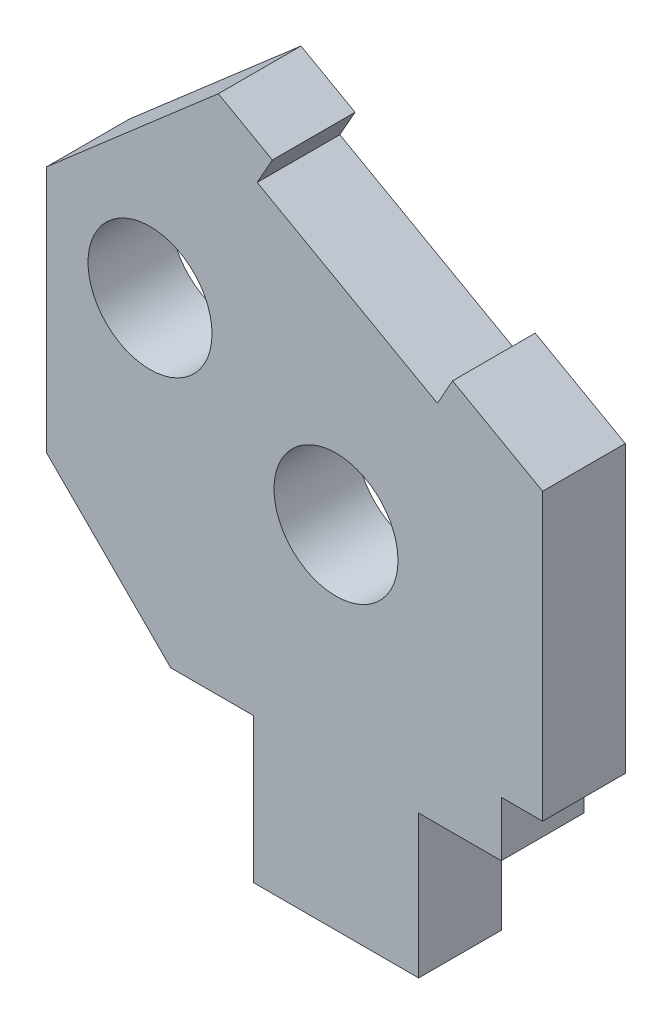
ISO-10303-21;
HEADER;
FILE_DESCRIPTION(('STEP AP214'),'2;1');
FILE_NAME('part.step','',(''),(''),'','','');
FILE_SCHEMA(('AUTOMOTIVE_DESIGN { 1 0 10303 214 1 1 1 1 }'));
ENDSEC;
DATA;
#1=APPLICATION_CONTEXT('core data for automotive mechanical design processes');
#2=APPLICATION_PROTOCOL_DEFINITION('international standard','automotive_design',2000,#1);
#3=PRODUCT_CONTEXT('',#1,'mechanical');
#4=PRODUCT('Part','Part','',(#3));
#5=PRODUCT_RELATED_PRODUCT_CATEGORY('part','',(#4));
#6=PRODUCT_DEFINITION_FORMATION('','',#4);
#7=PRODUCT_DEFINITION_CONTEXT('part definition',#1,'design');
#8=PRODUCT_DEFINITION('design','',#6,#7);
#9=PRODUCT_DEFINITION_SHAPE('','',#8);
#10=(LENGTH_UNIT() NAMED_UNIT(*) SI_UNIT(.MILLI.,.METRE.));
#11=(NAMED_UNIT(*) PLANE_ANGLE_UNIT() SI_UNIT($,.RADIAN.));
#12=(NAMED_UNIT(*) SI_UNIT($,.STERADIAN.) SOLID_ANGLE_UNIT());
#13=UNCERTAINTY_MEASURE_WITH_UNIT(LENGTH_MEASURE(1.E-05),#10,'distance_accuracy_value','');
#14=(GEOMETRIC_REPRESENTATION_CONTEXT(3) GLOBAL_UNCERTAINTY_ASSIGNED_CONTEXT((#13)) GLOBAL_UNIT_ASSIGNED_CONTEXT((#10,
#11,#12)) REPRESENTATION_CONTEXT('',''));
#15=CARTESIAN_POINT('',(0.,0.,0.));
#16=DIRECTION('',(0.,0.,1.));
#17=DIRECTION('',(1.,0.,0.));
#18=AXIS2_PLACEMENT_3D('',#15,#16,#17);
#19=CARTESIAN_POINT('',(0.,0.,4.));
#20=DIRECTION('',(0.,0.,1.));
#21=DIRECTION('',(1.,0.,0.));
#22=AXIS2_PLACEMENT_3D('',#19,#20,#21);
#23=PLANE('',#22);
#24=CARTESIAN_POINT('',(-5.00000000000018,22.,4.));
#25=DIRECTION('',(0.,0.,1.));
#26=DIRECTION('',(1.,0.,0.));
#27=AXIS2_PLACEMENT_3D('',#24,#25,#26);
#28=CIRCLE('',#27,3.);
#29=CARTESIAN_POINT('',(-2.00000000000018,22.,4.));
#30=VERTEX_POINT('',#29);
#31=EDGE_CURVE('E184',#30,#30,#28,.T.);
#32=ORIENTED_EDGE('',*,*,#31,.F.);
#33=EDGE_LOOP('',(#32));
#34=FACE_BOUND('',#33,.T.);
#35=DIRECTION('',(1.,0.,0.));
#36=VECTOR('',#35,1.);
#37=CARTESIAN_POINT('',(14.0000000000007,9.57269183261323,4.));
#38=LINE('',#37,#36);
#39=CARTESIAN_POINT('',(12.0000000000007,9.57269183261323,4.));
#40=VERTEX_POINT('',#39);
#41=CARTESIAN_POINT('',(14.0000000000007,9.57269183261323,4.));
#42=VERTEX_POINT('',#41);
#43=EDGE_CURVE('E210',#40,#42,#38,.T.);
#44=ORIENTED_EDGE('',*,*,#43,.T.);
#45=DIRECTION('',(0.,1.,0.));
#46=VECTOR('',#45,1.);
#47=CARTESIAN_POINT('',(14.0000000000006,23.3993728390653,4.));
#48=LINE('',#47,#46);
#49=CARTESIAN_POINT('',(14.0000000000006,23.3993728390653,4.));
#50=VERTEX_POINT('',#49);
#51=EDGE_CURVE('E120',#42,#50,#48,.T.);
#52=ORIENTED_EDGE('',*,*,#51,.T.);
#53=DIRECTION('',(-0.871930936284606,0.489628882266816,0.));
#54=VECTOR('',#53,1.);
#55=CARTESIAN_POINT('',(9.64034531857762,25.8475172503994,4.));
#56=LINE('',#55,#54);
#57=CARTESIAN_POINT('',(9.64034531857762,25.8475172503994,4.));
#58=VERTEX_POINT('',#57);
#59=EDGE_CURVE('E286',#50,#58,#56,.T.);
#60=ORIENTED_EDGE('',*,*,#59,.T.);
#61=DIRECTION('',(-0.489628882266828,-0.871930936284599,0.));
#62=VECTOR('',#61,1.);
#63=CARTESIAN_POINT('',(8.90590199517738,24.5396208459725,4.));
#64=LINE('',#63,#62);
#65=CARTESIAN_POINT('',(8.90590199517738,24.5396208459725,4.));
#66=VERTEX_POINT('',#65);
#67=EDGE_CURVE('E284',#58,#66,#64,.T.);
#68=ORIENTED_EDGE('',*,*,#67,.T.);
#69=DIRECTION('',(-0.871930936284605,0.489628882266816,0.));
#70=VECTOR('',#69,1.);
#71=CARTESIAN_POINT('',(0.186592632331326,29.4359096686407,4.));
#72=LINE('',#71,#70);
#73=CARTESIAN_POINT('',(0.186592632331326,29.4359096686407,4.));
#74=VERTEX_POINT('',#73);
#75=EDGE_CURVE('E282',#66,#74,#72,.T.);
#76=ORIENTED_EDGE('',*,*,#75,.T.);
#77=DIRECTION('',(0.489628882266816,0.871930936284605,0.));
#78=VECTOR('',#77,1.);
#79=CARTESIAN_POINT('',(0.921035955731546,30.7438060730676,4.));
#80=LINE('',#79,#78);
#81=CARTESIAN_POINT('',(0.921035955731546,30.7438060730676,4.));
#82=VERTEX_POINT('',#81);
#83=EDGE_CURVE('E280',#74,#82,#80,.T.);
#84=ORIENTED_EDGE('',*,*,#83,.T.);
#85=DIRECTION('',(-0.871930936284605,0.489628882266816,0.));
#86=VECTOR('',#85,1.);
#87=CARTESIAN_POINT('',(-1.69475685312225,32.212692719868,4.));
#88=LINE('',#87,#86);
#89=CARTESIAN_POINT('',(-1.69475685312225,32.212692719868,4.));
#90=VERTEX_POINT('',#89);
#91=EDGE_CURVE('E278',#82,#90,#88,.T.);
#92=ORIENTED_EDGE('',*,*,#91,.T.);
#93=DIRECTION('',(-0.75502210426163,-0.65569933816982,0.));
#94=VECTOR('',#93,1.);
#95=CARTESIAN_POINT('',(-10.0000000000002,25.,4.));
#96=LINE('',#95,#94);
#97=CARTESIAN_POINT('',(-10.0000000000002,25.,4.));
#98=VERTEX_POINT('',#97);
#99=EDGE_CURVE('E274',#90,#98,#96,.T.);
#100=ORIENTED_EDGE('',*,*,#99,.T.);
#101=DIRECTION('',(0.,-1.,0.));
#102=VECTOR('',#101,1.);
#103=CARTESIAN_POINT('',(-10.0000000000002,25.,4.));
#104=LINE('',#103,#102);
#105=CARTESIAN_POINT('',(-10.0000000000002,13.,4.));
#106=VERTEX_POINT('',#105);
#107=EDGE_CURVE('E267',#98,#106,#104,.T.);
#108=ORIENTED_EDGE('',*,*,#107,.T.);
#109=DIRECTION('',(-0.707106781186543,0.707106781186552,0.));
#110=VECTOR('',#109,1.);
#111=CARTESIAN_POINT('',(-3.99999999999998,6.99999999999995,4.));
#112=LINE('',#111,#110);
#113=CARTESIAN_POINT('',(-3.99999999999998,7.,4.));
#114=VERTEX_POINT('',#113);
#115=EDGE_CURVE('E11',#106,#114,#112,.F.);
#116=ORIENTED_EDGE('',*,*,#115,.T.);
#117=DIRECTION('',(1.,0.,0.));
#118=VECTOR('',#117,1.);
#119=CARTESIAN_POINT('',(-3.99999999999998,7.,4.));
#120=LINE('',#119,#118);
#121=CARTESIAN_POINT('',(0.,7.,4.));
#122=VERTEX_POINT('',#121);
#123=EDGE_CURVE('E265',#114,#122,#120,.T.);
#124=ORIENTED_EDGE('',*,*,#123,.T.);
#125=DIRECTION('',(0.,-1.,0.));
#126=VECTOR('',#125,1.);
#127=CARTESIAN_POINT('',(0.,7.,4.));
#128=LINE('',#127,#126);
#129=CARTESIAN_POINT('',(0.,0.,4.));
#130=VERTEX_POINT('',#129);
#131=EDGE_CURVE('E271',#122,#130,#128,.T.);
#132=ORIENTED_EDGE('',*,*,#131,.T.);
#133=DIRECTION('',(1.,0.,0.));
#134=VECTOR('',#133,1.);
#135=CARTESIAN_POINT('',(0.,0.,4.));
#136=LINE('',#135,#134);
#137=CARTESIAN_POINT('',(8.00000000000002,0.,4.));
#138=VERTEX_POINT('',#137);
#139=EDGE_CURVE('E162',#130,#138,#136,.T.);
#140=ORIENTED_EDGE('',*,*,#139,.T.);
#141=DIRECTION('',(0.,1.,0.));
#142=VECTOR('',#141,1.);
#143=CARTESIAN_POINT('',(8.00000000000002,0.,4.));
#144=LINE('',#143,#142);
#145=CARTESIAN_POINT('',(8.,6.91505180853556,4.));
#146=VERTEX_POINT('',#145);
#147=EDGE_CURVE('E156',#138,#146,#144,.T.);
#148=ORIENTED_EDGE('',*,*,#147,.T.);
#149=DIRECTION('',(1.,0.,0.));
#150=VECTOR('',#149,1.);
#151=CARTESIAN_POINT('',(8.,6.91505180853556,4.));
#152=LINE('',#151,#150);
#153=CARTESIAN_POINT('',(12.0000000000006,6.91505180853556,4.));
#154=VERTEX_POINT('',#153);
#155=EDGE_CURVE('E160',#146,#154,#152,.T.);
#156=ORIENTED_EDGE('',*,*,#155,.T.);
#157=DIRECTION('',(0.,1.,0.));
#158=VECTOR('',#157,1.);
#159=CARTESIAN_POINT('',(12.0000000000007,9.57269183261323,4.));
#160=LINE('',#159,#158);
#161=EDGE_CURVE('E52',#154,#40,#160,.T.);
#162=ORIENTED_EDGE('',*,*,#161,.T.);
#163=EDGE_LOOP('',(#44,#52,#60,#68,#76,#84,#92,#100,#108,#116,#124,#132,#140,#148,#156,#162));
#164=FACE_BOUND('',#163,.T.);
#165=CARTESIAN_POINT('',(3.99999999999982,17.,4.));
#166=DIRECTION('',(0.,0.,1.));
#167=DIRECTION('',(1.,0.,0.));
#168=AXIS2_PLACEMENT_3D('',#165,#166,#167);
#169=CIRCLE('',#168,3.);
#170=CARTESIAN_POINT('',(6.99999999999982,17.,4.));
#171=VERTEX_POINT('',#170);
#172=EDGE_CURVE('E293',#171,#171,#169,.T.);
#173=ORIENTED_EDGE('',*,*,#172,.F.);
#174=EDGE_LOOP('',(#173));
#175=FACE_BOUND('',#174,.T.);
#176=ADVANCED_FACE('F35',(#34,#164,#175),#23,.T.);
#177=CARTESIAN_POINT('',(0.,0.,0.));
#178=DIRECTION('',(0.,0.,1.));
#179=DIRECTION('',(1.,0.,0.));
#180=AXIS2_PLACEMENT_3D('',#177,#178,#179);
#181=PLANE('',#180);
#182=CARTESIAN_POINT('',(-5.00000000000018,22.,0.));
#183=DIRECTION('',(0.,0.,1.));
#184=DIRECTION('',(1.,0.,0.));
#185=AXIS2_PLACEMENT_3D('',#182,#183,#184);
#186=CIRCLE('',#185,3.);
#187=CARTESIAN_POINT('',(-2.00000000000018,22.,0.));
#188=VERTEX_POINT('',#187);
#189=EDGE_CURVE('E290',#188,#188,#186,.T.);
#190=ORIENTED_EDGE('',*,*,#189,.T.);
#191=EDGE_LOOP('',(#190));
#192=FACE_BOUND('',#191,.T.);
#193=DIRECTION('',(1.,0.,0.));
#194=VECTOR('',#193,1.);
#195=CARTESIAN_POINT('',(14.0000000000007,9.57269183261323,0.));
#196=LINE('',#195,#194);
#197=CARTESIAN_POINT('',(12.0000000000007,9.57269183261323,0.));
#198=VERTEX_POINT('',#197);
#199=CARTESIAN_POINT('',(14.0000000000007,9.57269183261323,0.));
#200=VERTEX_POINT('',#199);
#201=EDGE_CURVE('E180',#198,#200,#196,.T.);
#202=ORIENTED_EDGE('',*,*,#201,.F.);
#203=DIRECTION('',(0.,1.,0.));
#204=VECTOR('',#203,1.);
#205=CARTESIAN_POINT('',(12.0000000000007,9.57269183261323,0.));
#206=LINE('',#205,#204);
#207=CARTESIAN_POINT('',(12.0000000000006,6.91505180853556,0.));
#208=VERTEX_POINT('',#207);
#209=EDGE_CURVE('E111',#208,#198,#206,.T.);
#210=ORIENTED_EDGE('',*,*,#209,.F.);
#211=DIRECTION('',(1.,0.,0.));
#212=VECTOR('',#211,1.);
#213=CARTESIAN_POINT('',(8.,6.91505180853556,0.));
#214=LINE('',#213,#212);
#215=CARTESIAN_POINT('',(8.,6.91505180853556,0.));
#216=VERTEX_POINT('',#215);
#217=EDGE_CURVE('E105',#216,#208,#214,.T.);
#218=ORIENTED_EDGE('',*,*,#217,.F.);
#219=DIRECTION('',(0.,1.,0.));
#220=VECTOR('',#219,1.);
#221=CARTESIAN_POINT('',(8.00000000000002,0.,0.));
#222=LINE('',#221,#220);
#223=CARTESIAN_POINT('',(8.00000000000002,0.,0.));
#224=VERTEX_POINT('',#223);
#225=EDGE_CURVE('E170',#224,#216,#222,.T.);
#226=ORIENTED_EDGE('',*,*,#225,.F.);
#227=DIRECTION('',(1.,0.,0.));
#228=VECTOR('',#227,1.);
#229=CARTESIAN_POINT('',(0.,0.,0.));
#230=LINE('',#229,#228);
#231=CARTESIAN_POINT('',(0.,0.,0.));
#232=VERTEX_POINT('',#231);
#233=EDGE_CURVE('E205',#232,#224,#230,.T.);
#234=ORIENTED_EDGE('',*,*,#233,.F.);
#235=DIRECTION('',(0.,-1.,0.));
#236=VECTOR('',#235,1.);
#237=CARTESIAN_POINT('',(0.,7.,0.));
#238=LINE('',#237,#236);
#239=CARTESIAN_POINT('',(0.,7.,0.));
#240=VERTEX_POINT('',#239);
#241=EDGE_CURVE('E203',#240,#232,#238,.T.);
#242=ORIENTED_EDGE('',*,*,#241,.F.);
#243=DIRECTION('',(1.,0.,0.));
#244=VECTOR('',#243,1.);
#245=CARTESIAN_POINT('',(-3.99999999999998,7.,0.));
#246=LINE('',#245,#244);
#247=CARTESIAN_POINT('',(-3.99999999999998,7.,0.));
#248=VERTEX_POINT('',#247);
#249=EDGE_CURVE('E201',#248,#240,#246,.T.);
#250=ORIENTED_EDGE('',*,*,#249,.F.);
#251=DIRECTION('',(0.707106781186543,-0.707106781186552,0.));
#252=VECTOR('',#251,1.);
#253=CARTESIAN_POINT('',(1.49999999999996,1.49999999999994,0.));
#254=LINE('',#253,#252);
#255=CARTESIAN_POINT('',(-10.0000000000002,13.,0.));
#256=VERTEX_POINT('',#255);
#257=EDGE_CURVE('E44',#248,#256,#254,.F.);
#258=ORIENTED_EDGE('',*,*,#257,.T.);
#259=DIRECTION('',(0.,-1.,0.));
#260=VECTOR('',#259,1.);
#261=CARTESIAN_POINT('',(-10.0000000000002,25.,0.));
#262=LINE('',#261,#260);
#263=CARTESIAN_POINT('',(-10.0000000000002,25.,0.));
#264=VERTEX_POINT('',#263);
#265=EDGE_CURVE('E198',#264,#256,#262,.T.);
#266=ORIENTED_EDGE('',*,*,#265,.F.);
#267=DIRECTION('',(-0.75502210426163,-0.65569933816982,0.));
#268=VECTOR('',#267,1.);
#269=CARTESIAN_POINT('',(-10.0000000000002,25.,0.));
#270=LINE('',#269,#268);
#271=CARTESIAN_POINT('',(-1.69475685312225,32.212692719868,0.));
#272=VERTEX_POINT('',#271);
#273=EDGE_CURVE('E196',#272,#264,#270,.T.);
#274=ORIENTED_EDGE('',*,*,#273,.F.);
#275=DIRECTION('',(-0.871930936284605,0.489628882266816,0.));
#276=VECTOR('',#275,1.);
#277=CARTESIAN_POINT('',(-1.69475685312225,32.212692719868,0.));
#278=LINE('',#277,#276);
#279=CARTESIAN_POINT('',(0.921035955731546,30.7438060730676,0.));
#280=VERTEX_POINT('',#279);
#281=EDGE_CURVE('E194',#280,#272,#278,.T.);
#282=ORIENTED_EDGE('',*,*,#281,.F.);
#283=DIRECTION('',(0.489628882266816,0.871930936284605,0.));
#284=VECTOR('',#283,1.);
#285=CARTESIAN_POINT('',(0.921035955731546,30.7438060730676,0.));
#286=LINE('',#285,#284);
#287=CARTESIAN_POINT('',(0.186592632331326,29.4359096686407,0.));
#288=VERTEX_POINT('',#287);
#289=EDGE_CURVE('E192',#288,#280,#286,.T.);
#290=ORIENTED_EDGE('',*,*,#289,.F.);
#291=DIRECTION('',(-0.871930936284605,0.489628882266816,0.));
#292=VECTOR('',#291,1.);
#293=CARTESIAN_POINT('',(0.186592632331326,29.4359096686407,0.));
#294=LINE('',#293,#292);
#295=CARTESIAN_POINT('',(8.90590199517738,24.5396208459725,0.));
#296=VERTEX_POINT('',#295);
#297=EDGE_CURVE('E190',#296,#288,#294,.T.);
#298=ORIENTED_EDGE('',*,*,#297,.F.);
#299=DIRECTION('',(-0.489628882266828,-0.871930936284599,0.));
#300=VECTOR('',#299,1.);
#301=CARTESIAN_POINT('',(8.90590199517738,24.5396208459725,0.));
#302=LINE('',#301,#300);
#303=CARTESIAN_POINT('',(9.64034531857762,25.8475172503994,0.));
#304=VERTEX_POINT('',#303);
#305=EDGE_CURVE('E188',#304,#296,#302,.T.);
#306=ORIENTED_EDGE('',*,*,#305,.F.);
#307=DIRECTION('',(-0.871930936284606,0.489628882266816,0.));
#308=VECTOR('',#307,1.);
#309=CARTESIAN_POINT('',(9.64034531857762,25.8475172503994,0.));
#310=LINE('',#309,#308);
#311=CARTESIAN_POINT('',(14.0000000000006,23.3993728390653,0.));
#312=VERTEX_POINT('',#311);
#313=EDGE_CURVE('E186',#312,#304,#310,.T.);
#314=ORIENTED_EDGE('',*,*,#313,.F.);
#315=DIRECTION('',(0.,1.,0.));
#316=VECTOR('',#315,1.);
#317=CARTESIAN_POINT('',(14.0000000000006,23.3993728390653,0.));
#318=LINE('',#317,#316);
#319=EDGE_CURVE('E183',#200,#312,#318,.T.);
#320=ORIENTED_EDGE('',*,*,#319,.F.);
#321=EDGE_LOOP('',(#202,#210,#218,#226,#234,#242,#250,#258,#266,#274,#282,#290,#298,#306,#314,#320));
#322=FACE_BOUND('',#321,.T.);
#323=CARTESIAN_POINT('',(3.99999999999982,17.,0.));
#324=DIRECTION('',(0.,0.,1.));
#325=DIRECTION('',(1.,0.,0.));
#326=AXIS2_PLACEMENT_3D('',#323,#324,#325);
#327=CIRCLE('',#326,3.);
#328=CARTESIAN_POINT('',(6.99999999999982,17.,0.));
#329=VERTEX_POINT('',#328);
#330=EDGE_CURVE('E296',#329,#329,#327,.T.);
#331=ORIENTED_EDGE('',*,*,#330,.T.);
#332=EDGE_LOOP('',(#331));
#333=FACE_BOUND('',#332,.T.);
#334=ADVANCED_FACE('F252',(#192,#322,#333),#181,.F.);
#335=CARTESIAN_POINT('',(14.0000000000007,9.57269183261323,4.));
#336=DIRECTION('',(0.,1.,0.));
#337=DIRECTION('',(0.,0.,1.));
#338=AXIS2_PLACEMENT_3D('',#335,#336,#337);
#339=PLANE('',#338);
#340=ORIENTED_EDGE('',*,*,#201,.T.);
#341=DIRECTION('',(0.,0.,-1.));
#342=VECTOR('',#341,1.);
#343=CARTESIAN_POINT('',(14.0000000000007,9.57269183261323,4.));
#344=LINE('',#343,#342);
#345=EDGE_CURVE('E247',#42,#200,#344,.T.);
#346=ORIENTED_EDGE('',*,*,#345,.F.);
#347=ORIENTED_EDGE('',*,*,#43,.F.);
#348=DIRECTION('',(0.,0.,-1.));
#349=VECTOR('',#348,1.);
#350=CARTESIAN_POINT('',(12.0000000000007,9.57269183261323,4.));
#351=LINE('',#350,#349);
#352=EDGE_CURVE('E176',#40,#198,#351,.T.);
#353=ORIENTED_EDGE('',*,*,#352,.T.);
#354=EDGE_LOOP('',(#340,#346,#347,#353));
#355=FACE_BOUND('',#354,.T.);
#356=ADVANCED_FACE('F310',(#355),#339,.F.);
#357=CARTESIAN_POINT('',(14.0000000000006,23.3993728390653,4.));
#358=DIRECTION('',(-1.,0.,0.));
#359=DIRECTION('',(0.,-1.,0.));
#360=AXIS2_PLACEMENT_3D('',#357,#358,#359);
#361=PLANE('',#360);
#362=ORIENTED_EDGE('',*,*,#319,.T.);
#363=DIRECTION('',(0.,0.,-1.));
#364=VECTOR('',#363,1.);
#365=CARTESIAN_POINT('',(14.0000000000006,23.3993728390653,4.));
#366=LINE('',#365,#364);
#367=EDGE_CURVE('E244',#50,#312,#366,.T.);
#368=ORIENTED_EDGE('',*,*,#367,.F.);
#369=ORIENTED_EDGE('',*,*,#51,.F.);
#370=ORIENTED_EDGE('',*,*,#345,.T.);
#371=EDGE_LOOP('',(#362,#368,#369,#370));
#372=FACE_BOUND('',#371,.T.);
#373=ADVANCED_FACE('F360',(#372),#361,.F.);
#374=CARTESIAN_POINT('',(9.64034531857762,25.8475172503994,4.));
#375=DIRECTION('',(-0.489628882266816,-0.871930936284606,0.));
#376=DIRECTION('',(0.871930936284606,-0.489628882266816,0.));
#377=AXIS2_PLACEMENT_3D('',#374,#375,#376);
#378=PLANE('',#377);
#379=ORIENTED_EDGE('',*,*,#313,.T.);
#380=DIRECTION('',(0.,0.,-1.));
#381=VECTOR('',#380,1.);
#382=CARTESIAN_POINT('',(9.64034531857762,25.8475172503994,4.));
#383=LINE('',#382,#381);
#384=EDGE_CURVE('E241',#58,#304,#383,.T.);
#385=ORIENTED_EDGE('',*,*,#384,.F.);
#386=ORIENTED_EDGE('',*,*,#59,.F.);
#387=ORIENTED_EDGE('',*,*,#367,.T.);
#388=EDGE_LOOP('',(#379,#385,#386,#387));
#389=FACE_BOUND('',#388,.T.);
#390=ADVANCED_FACE('F356',(#389),#378,.F.);
#391=CARTESIAN_POINT('',(8.90590199517738,24.5396208459725,4.));
#392=DIRECTION('',(0.871930936284599,-0.489628882266828,0.));
#393=DIRECTION('',(0.489628882266828,0.871930936284599,0.));
#394=AXIS2_PLACEMENT_3D('',#391,#392,#393);
#395=PLANE('',#394);
#396=ORIENTED_EDGE('',*,*,#305,.T.);
#397=DIRECTION('',(0.,0.,-1.));
#398=VECTOR('',#397,1.);
#399=CARTESIAN_POINT('',(8.90590199517738,24.5396208459725,4.));
#400=LINE('',#399,#398);
#401=EDGE_CURVE('E238',#66,#296,#400,.T.);
#402=ORIENTED_EDGE('',*,*,#401,.F.);
#403=ORIENTED_EDGE('',*,*,#67,.F.);
#404=ORIENTED_EDGE('',*,*,#384,.T.);
#405=EDGE_LOOP('',(#396,#402,#403,#404));
#406=FACE_BOUND('',#405,.T.);
#407=ADVANCED_FACE('F352',(#406),#395,.F.);
#408=CARTESIAN_POINT('',(0.186592632331326,29.4359096686407,4.));
#409=DIRECTION('',(-0.489628882266816,-0.871930936284605,0.));
#410=DIRECTION('',(0.871930936284605,-0.489628882266816,0.));
#411=AXIS2_PLACEMENT_3D('',#408,#409,#410);
#412=PLANE('',#411);
#413=ORIENTED_EDGE('',*,*,#297,.T.);
#414=DIRECTION('',(0.,0.,-1.));
#415=VECTOR('',#414,1.);
#416=CARTESIAN_POINT('',(0.186592632331326,29.4359096686407,4.));
#417=LINE('',#416,#415);
#418=EDGE_CURVE('E235',#74,#288,#417,.T.);
#419=ORIENTED_EDGE('',*,*,#418,.F.);
#420=ORIENTED_EDGE('',*,*,#75,.F.);
#421=ORIENTED_EDGE('',*,*,#401,.T.);
#422=EDGE_LOOP('',(#413,#419,#420,#421));
#423=FACE_BOUND('',#422,.T.);
#424=ADVANCED_FACE('F348',(#423),#412,.F.);
#425=CARTESIAN_POINT('',(0.921035955731546,30.7438060730676,4.));
#426=DIRECTION('',(-0.871930936284605,0.489628882266816,0.));
#427=DIRECTION('',(-0.489628882266816,-0.871930936284605,0.));
#428=AXIS2_PLACEMENT_3D('',#425,#426,#427);
#429=PLANE('',#428);
#430=ORIENTED_EDGE('',*,*,#289,.T.);
#431=DIRECTION('',(0.,0.,-1.));
#432=VECTOR('',#431,1.);
#433=CARTESIAN_POINT('',(0.921035955731546,30.7438060730676,4.));
#434=LINE('',#433,#432);
#435=EDGE_CURVE('E232',#82,#280,#434,.T.);
#436=ORIENTED_EDGE('',*,*,#435,.F.);
#437=ORIENTED_EDGE('',*,*,#83,.F.);
#438=ORIENTED_EDGE('',*,*,#418,.T.);
#439=EDGE_LOOP('',(#430,#436,#437,#438));
#440=FACE_BOUND('',#439,.T.);
#441=ADVANCED_FACE('F344',(#440),#429,.F.);
#442=CARTESIAN_POINT('',(-1.69475685312225,32.212692719868,4.));
#443=DIRECTION('',(-0.489628882266816,-0.871930936284605,0.));
#444=DIRECTION('',(0.871930936284605,-0.489628882266816,0.));
#445=AXIS2_PLACEMENT_3D('',#442,#443,#444);
#446=PLANE('',#445);
#447=ORIENTED_EDGE('',*,*,#281,.T.);
#448=DIRECTION('',(0.,0.,-1.));
#449=VECTOR('',#448,1.);
#450=CARTESIAN_POINT('',(-1.69475685312225,32.212692719868,4.));
#451=LINE('',#450,#449);
#452=EDGE_CURVE('E229',#90,#272,#451,.T.);
#453=ORIENTED_EDGE('',*,*,#452,.F.);
#454=ORIENTED_EDGE('',*,*,#91,.F.);
#455=ORIENTED_EDGE('',*,*,#435,.T.);
#456=EDGE_LOOP('',(#447,#453,#454,#455));
#457=FACE_BOUND('',#456,.T.);
#458=ADVANCED_FACE('F340',(#457),#446,.F.);
#459=CARTESIAN_POINT('',(-10.0000000000002,25.,4.));
#460=DIRECTION('',(0.65569933816982,-0.75502210426163,0.));
#461=DIRECTION('',(0.75502210426163,0.65569933816982,0.));
#462=AXIS2_PLACEMENT_3D('',#459,#460,#461);
#463=PLANE('',#462);
#464=ORIENTED_EDGE('',*,*,#273,.T.);
#465=DIRECTION('',(0.,0.,-1.));
#466=VECTOR('',#465,1.);
#467=CARTESIAN_POINT('',(-10.0000000000002,25.,4.));
#468=LINE('',#467,#466);
#469=EDGE_CURVE('E226',#98,#264,#468,.T.);
#470=ORIENTED_EDGE('',*,*,#469,.F.);
#471=ORIENTED_EDGE('',*,*,#99,.F.);
#472=ORIENTED_EDGE('',*,*,#452,.T.);
#473=EDGE_LOOP('',(#464,#470,#471,#472));
#474=FACE_BOUND('',#473,.T.);
#475=ADVANCED_FACE('F337',(#474),#463,.F.);
#476=CARTESIAN_POINT('',(-10.0000000000002,25.,4.));
#477=DIRECTION('',(1.,0.,0.));
#478=DIRECTION('',(0.,0.,-1.));
#479=AXIS2_PLACEMENT_3D('',#476,#477,#478);
#480=PLANE('',#479);
#481=ORIENTED_EDGE('',*,*,#265,.T.);
#482=DIRECTION('',(0.,0.,-1.));
#483=VECTOR('',#482,1.);
#484=CARTESIAN_POINT('',(-10.0000000000002,13.,4.));
#485=LINE('',#484,#483);
#486=EDGE_CURVE('E223',#106,#256,#485,.T.);
#487=ORIENTED_EDGE('',*,*,#486,.F.);
#488=ORIENTED_EDGE('',*,*,#107,.F.);
#489=ORIENTED_EDGE('',*,*,#469,.T.);
#490=EDGE_LOOP('',(#481,#487,#488,#489));
#491=FACE_BOUND('',#490,.T.);
#492=ADVANCED_FACE('F260',(#491),#480,.F.);
#493=CARTESIAN_POINT('',(-3.99999999999998,7.,4.));
#494=DIRECTION('',(0.,1.,0.));
#495=DIRECTION('',(0.,0.,1.));
#496=AXIS2_PLACEMENT_3D('',#493,#494,#495);
#497=PLANE('',#496);
#498=ORIENTED_EDGE('',*,*,#249,.T.);
#499=DIRECTION('',(0.,0.,-1.));
#500=VECTOR('',#499,1.);
#501=CARTESIAN_POINT('',(0.,7.,4.));
#502=LINE('',#501,#500);
#503=EDGE_CURVE('E217',#122,#240,#502,.T.);
#504=ORIENTED_EDGE('',*,*,#503,.F.);
#505=ORIENTED_EDGE('',*,*,#123,.F.);
#506=DIRECTION('',(0.,0.,-1.));
#507=VECTOR('',#506,1.);
#508=CARTESIAN_POINT('',(-3.99999999999998,7.,4.));
#509=LINE('',#508,#507);
#510=EDGE_CURVE('E220',#114,#248,#509,.T.);
#511=ORIENTED_EDGE('',*,*,#510,.T.);
#512=EDGE_LOOP('',(#498,#504,#505,#511));
#513=FACE_BOUND('',#512,.T.);
#514=ADVANCED_FACE('F269',(#513),#497,.F.);
#515=CARTESIAN_POINT('',(0.,7.,4.));
#516=DIRECTION('',(1.,0.,0.));
#517=DIRECTION('',(0.,1.,0.));
#518=AXIS2_PLACEMENT_3D('',#515,#516,#517);
#519=PLANE('',#518);
#520=ORIENTED_EDGE('',*,*,#241,.T.);
#521=DIRECTION('',(0.,0.,-1.));
#522=VECTOR('',#521,1.);
#523=CARTESIAN_POINT('',(0.,0.,4.));
#524=LINE('',#523,#522);
#525=EDGE_CURVE('E214',#130,#232,#524,.T.);
#526=ORIENTED_EDGE('',*,*,#525,.F.);
#527=ORIENTED_EDGE('',*,*,#131,.F.);
#528=ORIENTED_EDGE('',*,*,#503,.T.);
#529=EDGE_LOOP('',(#520,#526,#527,#528));
#530=FACE_BOUND('',#529,.T.);
#531=ADVANCED_FACE('F328',(#530),#519,.F.);
#532=CARTESIAN_POINT('',(0.,0.,4.));
#533=DIRECTION('',(0.,1.,0.));
#534=DIRECTION('',(0.,0.,1.));
#535=AXIS2_PLACEMENT_3D('',#532,#533,#534);
#536=PLANE('',#535);
#537=ORIENTED_EDGE('',*,*,#233,.T.);
#538=DIRECTION('',(0.,0.,-1.));
#539=VECTOR('',#538,1.);
#540=CARTESIAN_POINT('',(8.00000000000002,0.,4.));
#541=LINE('',#540,#539);
#542=EDGE_CURVE('E171',#138,#224,#541,.T.);
#543=ORIENTED_EDGE('',*,*,#542,.F.);
#544=ORIENTED_EDGE('',*,*,#139,.F.);
#545=ORIENTED_EDGE('',*,*,#525,.T.);
#546=EDGE_LOOP('',(#537,#543,#544,#545));
#547=FACE_BOUND('',#546,.T.);
#548=ADVANCED_FACE('F325',(#547),#536,.F.);
#549=CARTESIAN_POINT('',(8.00000000000002,0.,4.));
#550=DIRECTION('',(-1.,0.,0.));
#551=DIRECTION('',(0.,-1.,0.));
#552=AXIS2_PLACEMENT_3D('',#549,#550,#551);
#553=PLANE('',#552);
#554=ORIENTED_EDGE('',*,*,#225,.T.);
#555=DIRECTION('',(0.,0.,-1.));
#556=VECTOR('',#555,1.);
#557=CARTESIAN_POINT('',(8.,6.91505180853556,4.));
#558=LINE('',#557,#556);
#559=EDGE_CURVE('E167',#146,#216,#558,.T.);
#560=ORIENTED_EDGE('',*,*,#559,.F.);
#561=ORIENTED_EDGE('',*,*,#147,.F.);
#562=ORIENTED_EDGE('',*,*,#542,.T.);
#563=EDGE_LOOP('',(#554,#560,#561,#562));
#564=FACE_BOUND('',#563,.T.);
#565=ADVANCED_FACE('F168',(#564),#553,.F.);
#566=CARTESIAN_POINT('',(8.,6.91505180853556,4.));
#567=DIRECTION('',(0.,1.,0.));
#568=DIRECTION('',(0.,0.,1.));
#569=AXIS2_PLACEMENT_3D('',#566,#567,#568);
#570=PLANE('',#569);
#571=ORIENTED_EDGE('',*,*,#217,.T.);
#572=DIRECTION('',(0.,0.,-1.));
#573=VECTOR('',#572,1.);
#574=CARTESIAN_POINT('',(12.0000000000006,6.91505180853556,4.));
#575=LINE('',#574,#573);
#576=EDGE_CURVE('E172',#154,#208,#575,.T.);
#577=ORIENTED_EDGE('',*,*,#576,.F.);
#578=ORIENTED_EDGE('',*,*,#155,.F.);
#579=ORIENTED_EDGE('',*,*,#559,.T.);
#580=EDGE_LOOP('',(#571,#577,#578,#579));
#581=FACE_BOUND('',#580,.T.);
#582=ADVANCED_FACE('F174',(#581),#570,.F.);
#583=CARTESIAN_POINT('',(12.0000000000007,9.57269183261323,4.));
#584=DIRECTION('',(-1.,0.,0.));
#585=DIRECTION('',(0.,-1.,0.));
#586=AXIS2_PLACEMENT_3D('',#583,#584,#585);
#587=PLANE('',#586);
#588=ORIENTED_EDGE('',*,*,#209,.T.);
#589=ORIENTED_EDGE('',*,*,#352,.F.);
#590=ORIENTED_EDGE('',*,*,#161,.F.);
#591=ORIENTED_EDGE('',*,*,#576,.T.);
#592=EDGE_LOOP('',(#588,#589,#590,#591));
#593=FACE_BOUND('',#592,.T.);
#594=ADVANCED_FACE('F318',(#593),#587,.F.);
#595=CARTESIAN_POINT('',(-5.00000000000018,22.,4.));
#596=DIRECTION('',(0.,0.,-1.));
#597=DIRECTION('',(-1.,0.,0.));
#598=AXIS2_PLACEMENT_3D('',#595,#596,#597);
#599=CYLINDRICAL_SURFACE('',#598,3.);
#600=ORIENTED_EDGE('',*,*,#31,.T.);
#601=EDGE_LOOP('',(#600));
#602=FACE_BOUND('',#601,.T.);
#603=ORIENTED_EDGE('',*,*,#189,.F.);
#604=EDGE_LOOP('',(#603));
#605=FACE_BOUND('',#604,.T.);
#606=ADVANCED_FACE('F315',(#602,#605),#599,.F.);
#607=CARTESIAN_POINT('',(3.99999999999982,17.,4.));
#608=DIRECTION('',(0.,0.,-1.));
#609=DIRECTION('',(-1.,0.,0.));
#610=AXIS2_PLACEMENT_3D('',#607,#608,#609);
#611=CYLINDRICAL_SURFACE('',#610,3.);
#612=ORIENTED_EDGE('',*,*,#172,.T.);
#613=EDGE_LOOP('',(#612));
#614=FACE_BOUND('',#613,.T.);
#615=ORIENTED_EDGE('',*,*,#330,.F.);
#616=EDGE_LOOP('',(#615));
#617=FACE_BOUND('',#616,.T.);
#618=ADVANCED_FACE('F302',(#614,#617),#611,.F.);
#619=CARTESIAN_POINT('',(-3.99999999999998,6.99999999999995,4.));
#620=DIRECTION('',(-0.707106781186552,-0.707106781186543,0.));
#621=DIRECTION('',(0.,0.,1.));
#622=AXIS2_PLACEMENT_3D('',#619,#620,#621);
#623=PLANE('',#622);
#624=ORIENTED_EDGE('',*,*,#115,.F.);
#625=ORIENTED_EDGE('',*,*,#486,.T.);
#626=ORIENTED_EDGE('',*,*,#257,.F.);
#627=ORIENTED_EDGE('',*,*,#510,.F.);
#628=EDGE_LOOP('',(#624,#625,#626,#627));
#629=FACE_BOUND('',#628,.T.);
#630=ADVANCED_FACE('F37',(#629),#623,.T.);
#631=CLOSED_SHELL('',(#176,#334,#356,#373,#390,#407,#424,#441,#458,#475,#492,#514,#531,#548,
#565,#582,#594,#606,#618,#630));
#632=MANIFOLD_SOLID_BREP('B2',#631);
#633=ADVANCED_BREP_SHAPE_REPRESENTATION('',(#18,#632),#14);
#634=SHAPE_DEFINITION_REPRESENTATION(#9,#633);
ENDSEC;
END-ISO-10303-21;
